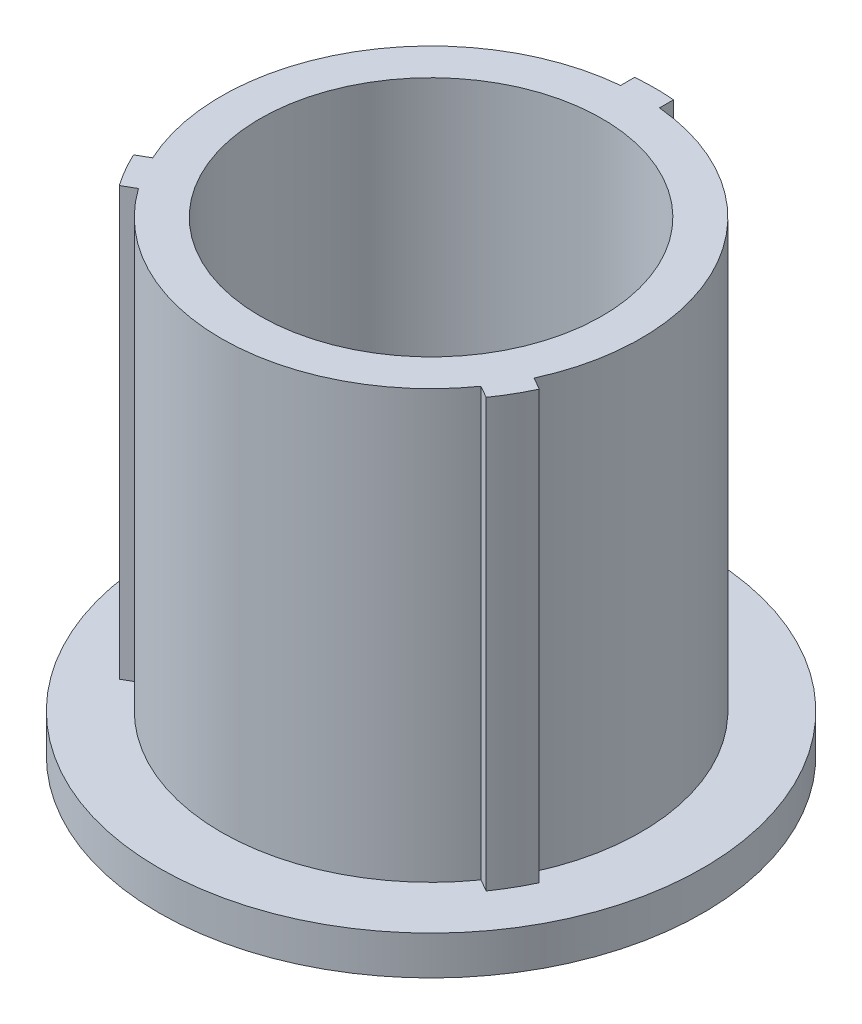
ISO-10303-21;
HEADER;
FILE_DESCRIPTION(('STEP AP214'),'2;1');
FILE_NAME('part.step','',(''),(''),'','','');
FILE_SCHEMA(('AUTOMOTIVE_DESIGN { 1 0 10303 214 1 1 1 1 }'));
ENDSEC;
DATA;
#1=APPLICATION_CONTEXT('core data for automotive mechanical design processes');
#2=APPLICATION_PROTOCOL_DEFINITION('international standard','automotive_design',2000,#1);
#3=PRODUCT_CONTEXT('',#1,'mechanical');
#4=PRODUCT('Part','Part','',(#3));
#5=PRODUCT_RELATED_PRODUCT_CATEGORY('part','',(#4));
#6=PRODUCT_DEFINITION_FORMATION('','',#4);
#7=PRODUCT_DEFINITION_CONTEXT('part definition',#1,'design');
#8=PRODUCT_DEFINITION('design','',#6,#7);
#9=PRODUCT_DEFINITION_SHAPE('','',#8);
#10=(LENGTH_UNIT() NAMED_UNIT(*) SI_UNIT(.MILLI.,.METRE.));
#11=(NAMED_UNIT(*) PLANE_ANGLE_UNIT() SI_UNIT($,.RADIAN.));
#12=(NAMED_UNIT(*) SI_UNIT($,.STERADIAN.) SOLID_ANGLE_UNIT());
#13=UNCERTAINTY_MEASURE_WITH_UNIT(LENGTH_MEASURE(1.E-05),#10,'distance_accuracy_value','');
#14=(GEOMETRIC_REPRESENTATION_CONTEXT(3) GLOBAL_UNCERTAINTY_ASSIGNED_CONTEXT((#13)) GLOBAL_UNIT_ASSIGNED_CONTEXT((#10,
#11,#12)) REPRESENTATION_CONTEXT('',''));
#15=CARTESIAN_POINT('',(0.,0.,0.));
#16=DIRECTION('',(0.,0.,1.));
#17=DIRECTION('',(1.,0.,0.));
#18=AXIS2_PLACEMENT_3D('',#15,#16,#17);
#19=CARTESIAN_POINT('',(0.,19.05,0.));
#20=DIRECTION('',(0.,-1.,0.));
#21=DIRECTION('',(0.,0.,-1.));
#22=AXIS2_PLACEMENT_3D('',#19,#20,#21);
#23=CYLINDRICAL_SURFACE('',#22,9.144);
#24=CARTESIAN_POINT('',(0.,1.58750000000001,0.));
#25=DIRECTION('',(0.,1.,0.));
#26=DIRECTION('',(0.,0.,1.));
#27=AXIS2_PLACEMENT_3D('',#24,#25,#26);
#28=CIRCLE('',#27,9.144);
#29=CARTESIAN_POINT('',(0.793749999999991,1.58750000000002,-9.10948390072127));
#30=VERTEX_POINT('',#29);
#31=CARTESIAN_POINT('',(-0.793750000000006,1.58750000000001,-9.10948390072127));
#32=VERTEX_POINT('',#31);
#33=EDGE_CURVE('E139',#30,#32,#28,.T.);
#34=ORIENTED_EDGE('',*,*,#33,.T.);
#35=DIRECTION('',(0.,-1.,0.));
#36=VECTOR('',#35,1.);
#37=CARTESIAN_POINT('',(-0.793750000000006,19.05,-9.10948390072127));
#38=LINE('',#37,#36);
#39=CARTESIAN_POINT('',(-0.793750000000006,19.05,-9.10948390072127));
#40=VERTEX_POINT('',#39);
#41=EDGE_CURVE('E40',#40,#32,#38,.T.);
#42=ORIENTED_EDGE('',*,*,#41,.F.);
#43=CARTESIAN_POINT('',(0.,19.05,0.));
#44=DIRECTION('',(0.,1.,0.));
#45=DIRECTION('',(0.,0.,1.));
#46=AXIS2_PLACEMENT_3D('',#43,#44,#45);
#47=CIRCLE('',#46,9.144);
#48=CARTESIAN_POINT('',(0.793749999999991,19.05,-9.10948390072127));
#49=VERTEX_POINT('',#48);
#50=EDGE_CURVE('E167',#49,#40,#47,.T.);
#51=ORIENTED_EDGE('',*,*,#50,.F.);
#52=DIRECTION('',(0.,-1.,0.));
#53=VECTOR('',#52,1.);
#54=CARTESIAN_POINT('',(0.793749999999991,19.05,-9.10948390072127));
#55=LINE('',#54,#53);
#56=EDGE_CURVE('E124',#49,#30,#55,.T.);
#57=ORIENTED_EDGE('',*,*,#56,.T.);
#58=EDGE_LOOP('',(#34,#42,#51,#57));
#59=FACE_BOUND('',#58,.T.);
#60=ADVANCED_FACE('F32',(#59),#23,.T.);
#61=CARTESIAN_POINT('',(-0.793750000000006,19.05,-9.10948390072127));
#62=DIRECTION('',(1.,0.,3.15542680651737E-13));
#63=DIRECTION('',(3.15542680651737E-13,0.,-1.));
#64=AXIS2_PLACEMENT_3D('',#61,#62,#63);
#65=PLANE('',#64);
#66=DIRECTION('',(3.15542680651737E-13,0.,-1.));
#67=VECTOR('',#66,1.);
#68=CARTESIAN_POINT('',(-0.793750000000006,1.58750000000001,-9.10948390072127));
#69=LINE('',#68,#67);
#70=CARTESIAN_POINT('',(-0.793750000000187,1.58750000000001,-8.53567321231897));
#71=VERTEX_POINT('',#70);
#72=EDGE_CURVE('E141',#71,#32,#69,.T.);
#73=ORIENTED_EDGE('',*,*,#72,.F.);
#74=DIRECTION('',(0.,-1.,0.));
#75=VECTOR('',#74,1.);
#76=CARTESIAN_POINT('',(-0.793750000000187,19.05,-8.53567321231897));
#77=LINE('',#76,#75);
#78=CARTESIAN_POINT('',(-0.793750000000187,19.05,-8.53567321231897));
#79=VERTEX_POINT('',#78);
#80=EDGE_CURVE('E213',#79,#71,#77,.T.);
#81=ORIENTED_EDGE('',*,*,#80,.F.);
#82=DIRECTION('',(-3.15542680651737E-13,0.,1.));
#83=VECTOR('',#82,1.);
#84=CARTESIAN_POINT('',(-0.793750000000006,19.05,-9.10948390072127));
#85=LINE('',#84,#83);
#86=EDGE_CURVE('E169',#40,#79,#85,.T.);
#87=ORIENTED_EDGE('',*,*,#86,.F.);
#88=ORIENTED_EDGE('',*,*,#41,.T.);
#89=EDGE_LOOP('',(#73,#81,#87,#88));
#90=FACE_BOUND('',#89,.T.);
#91=ADVANCED_FACE('F217',(#90),#65,.F.);
#92=CARTESIAN_POINT('',(0.,19.05,0.));
#93=DIRECTION('',(0.,-1.,0.));
#94=DIRECTION('',(0.,0.,-1.));
#95=AXIS2_PLACEMENT_3D('',#92,#93,#94);
#96=CYLINDRICAL_SURFACE('',#95,8.5725);
#97=CARTESIAN_POINT('',(0.,1.58750000000001,0.));
#98=DIRECTION('',(0.,-1.,0.));
#99=DIRECTION('',(0.,0.,-1.));
#100=AXIS2_PLACEMENT_3D('',#97,#98,#99);
#101=CIRCLE('',#100,8.5725);
#102=CARTESIAN_POINT('',(-7.78898484027049,1.58750000000001,3.58042894190577));
#103=VERTEX_POINT('',#102);
#104=EDGE_CURVE('E164',#103,#71,#101,.T.);
#105=ORIENTED_EDGE('',*,*,#104,.F.);
#106=DIRECTION('',(0.,-1.,0.));
#107=VECTOR('',#106,1.);
#108=CARTESIAN_POINT('',(-7.78898484027049,19.05,3.58042894190577));
#109=LINE('',#108,#107);
#110=CARTESIAN_POINT('',(-7.78898484027049,19.05,3.58042894190577));
#111=VERTEX_POINT('',#110);
#112=EDGE_CURVE('E210',#111,#103,#109,.T.);
#113=ORIENTED_EDGE('',*,*,#112,.F.);
#114=CARTESIAN_POINT('',(0.,19.05,0.));
#115=DIRECTION('',(0.,1.,0.));
#116=DIRECTION('',(0.,0.,1.));
#117=AXIS2_PLACEMENT_3D('',#114,#115,#116);
#118=CIRCLE('',#117,8.5725);
#119=EDGE_CURVE('E171',#79,#111,#118,.T.);
#120=ORIENTED_EDGE('',*,*,#119,.F.);
#121=ORIENTED_EDGE('',*,*,#80,.T.);
#122=EDGE_LOOP('',(#105,#113,#120,#121));
#123=FACE_BOUND('',#122,.T.);
#124=ADVANCED_FACE('F224',(#123),#96,.T.);
#125=CARTESIAN_POINT('',(-8.28591947338998,19.05,3.86733428610674));
#126=DIRECTION('',(0.499999999999724,0.,0.866025403784598));
#127=DIRECTION('',(0.866025403784598,0.,-0.499999999999724));
#128=AXIS2_PLACEMENT_3D('',#125,#126,#127);
#129=PLANE('',#128);
#130=DIRECTION('',(0.866025403784598,0.,-0.499999999999724));
#131=VECTOR('',#130,1.);
#132=CARTESIAN_POINT('',(-8.28591947338998,1.58750000000001,3.86733428610674));
#133=LINE('',#132,#131);
#134=CARTESIAN_POINT('',(-8.28591947338998,1.58750000000001,3.86733428610675));
#135=VERTEX_POINT('',#134);
#136=EDGE_CURVE('E161',#135,#103,#133,.T.);
#137=ORIENTED_EDGE('',*,*,#136,.F.);
#138=DIRECTION('',(0.,-1.,0.));
#139=VECTOR('',#138,1.);
#140=CARTESIAN_POINT('',(-8.28591947338998,19.05,3.86733428610674));
#141=LINE('',#140,#139);
#142=CARTESIAN_POINT('',(-8.28591947338998,19.05,3.86733428610674));
#143=VERTEX_POINT('',#142);
#144=EDGE_CURVE('E207',#143,#135,#141,.T.);
#145=ORIENTED_EDGE('',*,*,#144,.F.);
#146=DIRECTION('',(-0.866025403784598,0.,0.499999999999724));
#147=VECTOR('',#146,1.);
#148=CARTESIAN_POINT('',(-8.28591947338998,19.05,3.86733428610674));
#149=LINE('',#148,#147);
#150=EDGE_CURVE('E173',#111,#143,#149,.T.);
#151=ORIENTED_EDGE('',*,*,#150,.F.);
#152=ORIENTED_EDGE('',*,*,#112,.T.);
#153=EDGE_LOOP('',(#137,#145,#151,#152));
#154=FACE_BOUND('',#153,.T.);
#155=ADVANCED_FACE('F228',(#154),#129,.F.);
#156=CARTESIAN_POINT('',(0.,19.05,0.));
#157=DIRECTION('',(0.,-1.,0.));
#158=DIRECTION('',(0.,0.,-1.));
#159=AXIS2_PLACEMENT_3D('',#156,#157,#158);
#160=CYLINDRICAL_SURFACE('',#159,9.144);
#161=CARTESIAN_POINT('',(-7.49216947338998,1.58750000000001,5.24214961461454));
#162=VERTEX_POINT('',#161);
#163=EDGE_CURVE('E145',#135,#162,#28,.T.);
#164=ORIENTED_EDGE('',*,*,#163,.T.);
#165=DIRECTION('',(0.,-1.,0.));
#166=VECTOR('',#165,1.);
#167=CARTESIAN_POINT('',(-7.49216947338997,19.05,5.24214961461454));
#168=LINE('',#167,#166);
#169=CARTESIAN_POINT('',(-7.49216947338997,19.05,5.24214961461454));
#170=VERTEX_POINT('',#169);
#171=EDGE_CURVE('E204',#170,#162,#168,.T.);
#172=ORIENTED_EDGE('',*,*,#171,.F.);
#173=CARTESIAN_POINT('',(0.,19.05,0.));
#174=DIRECTION('',(0.,1.,0.));
#175=DIRECTION('',(0.,0.,1.));
#176=AXIS2_PLACEMENT_3D('',#173,#174,#175);
#177=CIRCLE('',#176,9.144);
#178=EDGE_CURVE('E175',#143,#170,#177,.T.);
#179=ORIENTED_EDGE('',*,*,#178,.F.);
#180=ORIENTED_EDGE('',*,*,#144,.T.);
#181=EDGE_LOOP('',(#164,#172,#179,#180));
#182=FACE_BOUND('',#181,.T.);
#183=ADVANCED_FACE('F234',(#182),#160,.T.);
#184=CARTESIAN_POINT('',(-7.49216947338998,19.05,5.24214961461454));
#185=DIRECTION('',(-0.499999999999723,0.,-0.866025403784599));
#186=DIRECTION('',(-0.866025403784599,0.,0.499999999999723));
#187=AXIS2_PLACEMENT_3D('',#184,#185,#186);
#188=PLANE('',#187);
#189=DIRECTION('',(-0.866025403784599,0.,0.499999999999723));
#190=VECTOR('',#189,1.);
#191=CARTESIAN_POINT('',(-7.49216947338998,1.58750000000001,5.24214961461454));
#192=LINE('',#191,#190);
#193=CARTESIAN_POINT('',(-6.99523484027046,1.58750000000001,4.95524427041355));
#194=VERTEX_POINT('',#193);
#195=EDGE_CURVE('E158',#194,#162,#192,.T.);
#196=ORIENTED_EDGE('',*,*,#195,.F.);
#197=DIRECTION('',(0.,-1.,0.));
#198=VECTOR('',#197,1.);
#199=CARTESIAN_POINT('',(-6.99523484027046,19.05,4.95524427041355));
#200=LINE('',#199,#198);
#201=CARTESIAN_POINT('',(-6.99523484027046,19.05,4.95524427041355));
#202=VERTEX_POINT('',#201);
#203=EDGE_CURVE('E201',#202,#194,#200,.T.);
#204=ORIENTED_EDGE('',*,*,#203,.F.);
#205=DIRECTION('',(0.866025403784599,0.,-0.499999999999723));
#206=VECTOR('',#205,1.);
#207=CARTESIAN_POINT('',(-7.49216947338998,19.05,5.24214961461454));
#208=LINE('',#207,#206);
#209=EDGE_CURVE('E177',#170,#202,#208,.T.);
#210=ORIENTED_EDGE('',*,*,#209,.F.);
#211=ORIENTED_EDGE('',*,*,#171,.T.);
#212=EDGE_LOOP('',(#196,#204,#210,#211));
#213=FACE_BOUND('',#212,.T.);
#214=ADVANCED_FACE('F237',(#213),#188,.F.);
#215=CARTESIAN_POINT('',(0.,19.05,0.));
#216=DIRECTION('',(0.,-1.,0.));
#217=DIRECTION('',(0.,0.,-1.));
#218=AXIS2_PLACEMENT_3D('',#215,#216,#217);
#219=CYLINDRICAL_SURFACE('',#218,8.5725);
#220=CARTESIAN_POINT('',(0.,1.58750000000001,0.));
#221=DIRECTION('',(0.,-1.,0.));
#222=DIRECTION('',(0.,0.,-1.));
#223=AXIS2_PLACEMENT_3D('',#220,#221,#222);
#224=CIRCLE('',#223,8.5725);
#225=CARTESIAN_POINT('',(6.99523484027068,1.58750000000001,4.95524427041324));
#226=VERTEX_POINT('',#225);
#227=EDGE_CURVE('E155',#226,#194,#224,.T.);
#228=ORIENTED_EDGE('',*,*,#227,.F.);
#229=DIRECTION('',(0.,-1.,0.));
#230=VECTOR('',#229,1.);
#231=CARTESIAN_POINT('',(6.99523484027068,19.05,4.95524427041324));
#232=LINE('',#231,#230);
#233=CARTESIAN_POINT('',(6.99523484027068,19.05,4.95524427041324));
#234=VERTEX_POINT('',#233);
#235=EDGE_CURVE('E198',#234,#226,#232,.T.);
#236=ORIENTED_EDGE('',*,*,#235,.F.);
#237=CARTESIAN_POINT('',(0.,19.05,0.));
#238=DIRECTION('',(0.,1.,0.));
#239=DIRECTION('',(0.,0.,1.));
#240=AXIS2_PLACEMENT_3D('',#237,#238,#239);
#241=CIRCLE('',#240,8.5725);
#242=EDGE_CURVE('E179',#202,#234,#241,.T.);
#243=ORIENTED_EDGE('',*,*,#242,.F.);
#244=ORIENTED_EDGE('',*,*,#203,.T.);
#245=EDGE_LOOP('',(#228,#236,#243,#244));
#246=FACE_BOUND('',#245,.T.);
#247=ADVANCED_FACE('F241',(#246),#219,.T.);
#248=CARTESIAN_POINT('',(7.49216947338998,19.05,5.24214961461453));
#249=DIRECTION('',(0.500000000000273,0.,-0.866025403784281));
#250=DIRECTION('',(-0.866025403784281,0.,-0.500000000000273));
#251=AXIS2_PLACEMENT_3D('',#248,#249,#250);
#252=PLANE('',#251);
#253=DIRECTION('',(-0.866025403784281,0.,-0.500000000000273));
#254=VECTOR('',#253,1.);
#255=CARTESIAN_POINT('',(7.49216947338998,1.58750000000001,5.24214961461453));
#256=LINE('',#255,#254);
#257=CARTESIAN_POINT('',(7.49216947338998,1.58750000000001,5.24214961461453));
#258=VERTEX_POINT('',#257);
#259=EDGE_CURVE('E152',#258,#226,#256,.T.);
#260=ORIENTED_EDGE('',*,*,#259,.F.);
#261=DIRECTION('',(0.,-1.,0.));
#262=VECTOR('',#261,1.);
#263=CARTESIAN_POINT('',(7.49216947338998,19.05,5.24214961461453));
#264=LINE('',#263,#262);
#265=CARTESIAN_POINT('',(7.49216947338998,19.05,5.24214961461453));
#266=VERTEX_POINT('',#265);
#267=EDGE_CURVE('E195',#266,#258,#264,.T.);
#268=ORIENTED_EDGE('',*,*,#267,.F.);
#269=DIRECTION('',(0.866025403784281,0.,0.500000000000273));
#270=VECTOR('',#269,1.);
#271=CARTESIAN_POINT('',(7.49216947338998,19.05,5.24214961461453));
#272=LINE('',#271,#270);
#273=EDGE_CURVE('E181',#234,#266,#272,.T.);
#274=ORIENTED_EDGE('',*,*,#273,.F.);
#275=ORIENTED_EDGE('',*,*,#235,.T.);
#276=EDGE_LOOP('',(#260,#268,#274,#275));
#277=FACE_BOUND('',#276,.T.);
#278=ADVANCED_FACE('F247',(#277),#252,.F.);
#279=CARTESIAN_POINT('',(0.,19.05,0.));
#280=DIRECTION('',(0.,-1.,0.));
#281=DIRECTION('',(0.,0.,-1.));
#282=AXIS2_PLACEMENT_3D('',#279,#280,#281);
#283=CYLINDRICAL_SURFACE('',#282,9.144);
#284=CARTESIAN_POINT('',(8.28591947338998,1.58750000000001,3.86733428610673));
#285=VERTEX_POINT('',#284);
#286=EDGE_CURVE('E134',#258,#285,#28,.T.);
#287=ORIENTED_EDGE('',*,*,#286,.T.);
#288=DIRECTION('',(0.,-1.,0.));
#289=VECTOR('',#288,1.);
#290=CARTESIAN_POINT('',(8.28591947338998,19.05,3.86733428610673));
#291=LINE('',#290,#289);
#292=CARTESIAN_POINT('',(8.28591947338998,19.05,3.86733428610673));
#293=VERTEX_POINT('',#292);
#294=EDGE_CURVE('E192',#293,#285,#291,.T.);
#295=ORIENTED_EDGE('',*,*,#294,.F.);
#296=CARTESIAN_POINT('',(0.,19.05,0.));
#297=DIRECTION('',(0.,1.,0.));
#298=DIRECTION('',(0.,0.,1.));
#299=AXIS2_PLACEMENT_3D('',#296,#297,#298);
#300=CIRCLE('',#299,9.144);
#301=EDGE_CURVE('E183',#266,#293,#300,.T.);
#302=ORIENTED_EDGE('',*,*,#301,.F.);
#303=ORIENTED_EDGE('',*,*,#267,.T.);
#304=EDGE_LOOP('',(#287,#295,#302,#303));
#305=FACE_BOUND('',#304,.T.);
#306=ADVANCED_FACE('F250',(#305),#283,.T.);
#307=CARTESIAN_POINT('',(8.28591947338998,19.05,3.86733428610673));
#308=DIRECTION('',(-0.500000000000288,0.,0.866025403784272));
#309=DIRECTION('',(0.866025403784273,0.,0.500000000000288));
#310=AXIS2_PLACEMENT_3D('',#307,#308,#309);
#311=PLANE('',#310);
#312=DIRECTION('',(0.866025403784273,0.,0.500000000000288));
#313=VECTOR('',#312,1.);
#314=CARTESIAN_POINT('',(8.28591947338998,1.58750000000001,3.86733428610673));
#315=LINE('',#314,#313);
#316=CARTESIAN_POINT('',(7.78898484027065,1.58750000000001,3.58042894190542));
#317=VERTEX_POINT('',#316);
#318=EDGE_CURVE('E133',#317,#285,#315,.T.);
#319=ORIENTED_EDGE('',*,*,#318,.F.);
#320=DIRECTION('',(0.,-1.,0.));
#321=VECTOR('',#320,1.);
#322=CARTESIAN_POINT('',(7.78898484027065,19.05,3.58042894190542));
#323=LINE('',#322,#321);
#324=CARTESIAN_POINT('',(7.78898484027065,19.05,3.58042894190542));
#325=VERTEX_POINT('',#324);
#326=EDGE_CURVE('E123',#325,#317,#323,.T.);
#327=ORIENTED_EDGE('',*,*,#326,.F.);
#328=DIRECTION('',(-0.866025403784273,0.,-0.500000000000288));
#329=VECTOR('',#328,1.);
#330=CARTESIAN_POINT('',(8.28591947338998,19.05,3.86733428610673));
#331=LINE('',#330,#329);
#332=EDGE_CURVE('E185',#293,#325,#331,.T.);
#333=ORIENTED_EDGE('',*,*,#332,.F.);
#334=ORIENTED_EDGE('',*,*,#294,.T.);
#335=EDGE_LOOP('',(#319,#327,#333,#334));
#336=FACE_BOUND('',#335,.T.);
#337=ADVANCED_FACE('F253',(#336),#311,.F.);
#338=CARTESIAN_POINT('',(0.,19.05,0.));
#339=DIRECTION('',(0.,-1.,0.));
#340=DIRECTION('',(0.,0.,-1.));
#341=AXIS2_PLACEMENT_3D('',#338,#339,#340);
#342=CYLINDRICAL_SURFACE('',#341,8.5725);
#343=CARTESIAN_POINT('',(0.,1.58750000000001,0.));
#344=DIRECTION('',(0.,-1.,0.));
#345=DIRECTION('',(0.,0.,-1.));
#346=AXIS2_PLACEMENT_3D('',#343,#344,#345);
#347=CIRCLE('',#346,8.5725);
#348=CARTESIAN_POINT('',(0.793749999999813,1.58750000000001,-8.53567321231901));
#349=VERTEX_POINT('',#348);
#350=EDGE_CURVE('E128',#349,#317,#347,.T.);
#351=ORIENTED_EDGE('',*,*,#350,.F.);
#352=DIRECTION('',(0.,-1.,0.));
#353=VECTOR('',#352,1.);
#354=CARTESIAN_POINT('',(0.793749999999815,19.05,-8.53567321231901));
#355=LINE('',#354,#353);
#356=CARTESIAN_POINT('',(0.793749999999815,19.05,-8.53567321231901));
#357=VERTEX_POINT('',#356);
#358=EDGE_CURVE('E118',#357,#349,#355,.T.);
#359=ORIENTED_EDGE('',*,*,#358,.F.);
#360=CARTESIAN_POINT('',(0.,19.05,0.));
#361=DIRECTION('',(0.,1.,0.));
#362=DIRECTION('',(0.,0.,1.));
#363=AXIS2_PLACEMENT_3D('',#360,#361,#362);
#364=CIRCLE('',#363,8.5725);
#365=EDGE_CURVE('E187',#325,#357,#364,.T.);
#366=ORIENTED_EDGE('',*,*,#365,.F.);
#367=ORIENTED_EDGE('',*,*,#326,.T.);
#368=EDGE_LOOP('',(#351,#359,#366,#367));
#369=FACE_BOUND('',#368,.T.);
#370=ADVANCED_FACE('F129',(#369),#342,.T.);
#371=CARTESIAN_POINT('',(0.793749999999991,19.05,-9.10948390072127));
#372=DIRECTION('',(-1.,0.,-3.11196883253559E-13));
#373=DIRECTION('',(-3.11196883253559E-13,0.,1.));
#374=AXIS2_PLACEMENT_3D('',#371,#372,#373);
#375=PLANE('',#374);
#376=DIRECTION('',(-3.11196883253559E-13,0.,1.));
#377=VECTOR('',#376,1.);
#378=CARTESIAN_POINT('',(0.793749999999991,1.58750000000001,-9.10948390072127));
#379=LINE('',#378,#377);
#380=EDGE_CURVE('E11',#30,#349,#379,.T.);
#381=ORIENTED_EDGE('',*,*,#380,.F.);
#382=ORIENTED_EDGE('',*,*,#56,.F.);
#383=DIRECTION('',(3.11196883253559E-13,0.,-1.));
#384=VECTOR('',#383,1.);
#385=CARTESIAN_POINT('',(0.793749999999991,19.05,-9.10948390072127));
#386=LINE('',#385,#384);
#387=EDGE_CURVE('E53',#357,#49,#386,.T.);
#388=ORIENTED_EDGE('',*,*,#387,.F.);
#389=ORIENTED_EDGE('',*,*,#358,.T.);
#390=EDGE_LOOP('',(#381,#382,#388,#389));
#391=FACE_BOUND('',#390,.T.);
#392=ADVANCED_FACE('F120',(#391),#375,.F.);
#393=CARTESIAN_POINT('',(0.,19.05,0.));
#394=DIRECTION('',(0.,1.,0.));
#395=DIRECTION('',(0.,0.,1.));
#396=AXIS2_PLACEMENT_3D('',#393,#394,#395);
#397=PLANE('',#396);
#398=CARTESIAN_POINT('',(0.,19.05,0.));
#399=DIRECTION('',(0.,1.,0.));
#400=DIRECTION('',(0.,0.,1.));
#401=AXIS2_PLACEMENT_3D('',#398,#399,#400);
#402=CIRCLE('',#401,6.985);
#403=CARTESIAN_POINT('',(0.,19.05,6.985));
#404=VERTEX_POINT('',#403);
#405=EDGE_CURVE('E383',#404,#404,#402,.T.);
#406=ORIENTED_EDGE('',*,*,#405,.F.);
#407=EDGE_LOOP('',(#406));
#408=FACE_BOUND('',#407,.T.);
#409=ORIENTED_EDGE('',*,*,#50,.T.);
#410=ORIENTED_EDGE('',*,*,#86,.T.);
#411=ORIENTED_EDGE('',*,*,#119,.T.);
#412=ORIENTED_EDGE('',*,*,#150,.T.);
#413=ORIENTED_EDGE('',*,*,#178,.T.);
#414=ORIENTED_EDGE('',*,*,#209,.T.);
#415=ORIENTED_EDGE('',*,*,#242,.T.);
#416=ORIENTED_EDGE('',*,*,#273,.T.);
#417=ORIENTED_EDGE('',*,*,#301,.T.);
#418=ORIENTED_EDGE('',*,*,#332,.T.);
#419=ORIENTED_EDGE('',*,*,#365,.T.);
#420=ORIENTED_EDGE('',*,*,#387,.T.);
#421=EDGE_LOOP('',(#409,#410,#411,#412,#413,#414,#415,#416,#417,#418,#419,#420));
#422=FACE_BOUND('',#421,.T.);
#423=ADVANCED_FACE('F220',(#408,#422),#397,.T.);
#424=CARTESIAN_POINT('',(0.,1.58750000000001,-8.53567321231901));
#425=DIRECTION('',(0.,-1.,0.));
#426=DIRECTION('',(0.,0.,-1.));
#427=AXIS2_PLACEMENT_3D('',#424,#425,#426);
#428=PLANE('',#427);
#429=CARTESIAN_POINT('',(0.,1.58750000000001,0.));
#430=DIRECTION('',(0.,1.,0.));
#431=DIRECTION('',(0.,0.,1.));
#432=AXIS2_PLACEMENT_3D('',#429,#430,#431);
#433=CIRCLE('',#432,11.1125);
#434=CARTESIAN_POINT('',(0.,1.58750000000001,11.1125));
#435=VERTEX_POINT('',#434);
#436=EDGE_CURVE('E388',#435,#435,#433,.T.);
#437=ORIENTED_EDGE('',*,*,#436,.T.);
#438=EDGE_LOOP('',(#437));
#439=FACE_BOUND('',#438,.T.);
#440=ORIENTED_EDGE('',*,*,#72,.T.);
#441=ORIENTED_EDGE('',*,*,#33,.F.);
#442=ORIENTED_EDGE('',*,*,#380,.T.);
#443=ORIENTED_EDGE('',*,*,#350,.T.);
#444=ORIENTED_EDGE('',*,*,#318,.T.);
#445=ORIENTED_EDGE('',*,*,#286,.F.);
#446=ORIENTED_EDGE('',*,*,#259,.T.);
#447=ORIENTED_EDGE('',*,*,#227,.T.);
#448=ORIENTED_EDGE('',*,*,#195,.T.);
#449=ORIENTED_EDGE('',*,*,#163,.F.);
#450=ORIENTED_EDGE('',*,*,#136,.T.);
#451=ORIENTED_EDGE('',*,*,#104,.T.);
#452=EDGE_LOOP('',(#440,#441,#442,#443,#444,#445,#446,#447,#448,#449,#450,#451));
#453=FACE_BOUND('',#452,.T.);
#454=ADVANCED_FACE('F138',(#439,#453),#428,.F.);
#455=CARTESIAN_POINT('',(0.,4.48386457997676,0.));
#456=DIRECTION('',(0.,1.,0.));
#457=DIRECTION('',(0.,0.,1.));
#458=AXIS2_PLACEMENT_3D('',#455,#456,#457);
#459=CYLINDRICAL_SURFACE('',#458,11.1125);
#460=ORIENTED_EDGE('',*,*,#436,.F.);
#461=EDGE_LOOP('',(#460));
#462=FACE_BOUND('',#461,.T.);
#463=CARTESIAN_POINT('',(0.,0.,0.));
#464=DIRECTION('',(0.,1.,0.));
#465=DIRECTION('',(0.,0.,1.));
#466=AXIS2_PLACEMENT_3D('',#463,#464,#465);
#467=CIRCLE('',#466,11.1125);
#468=CARTESIAN_POINT('',(0.,0.,11.1125));
#469=VERTEX_POINT('',#468);
#470=EDGE_CURVE('E147',#469,#469,#467,.T.);
#471=ORIENTED_EDGE('',*,*,#470,.T.);
#472=EDGE_LOOP('',(#471));
#473=FACE_BOUND('',#472,.T.);
#474=ADVANCED_FACE('F317',(#462,#473),#459,.T.);
#475=CARTESIAN_POINT('',(0.,0.,0.));
#476=DIRECTION('',(0.,1.,0.));
#477=DIRECTION('',(0.,0.,1.));
#478=AXIS2_PLACEMENT_3D('',#475,#476,#477);
#479=PLANE('',#478);
#480=CARTESIAN_POINT('',(0.,0.,0.));
#481=DIRECTION('',(0.,-1.,0.));
#482=DIRECTION('',(0.,0.,-1.));
#483=AXIS2_PLACEMENT_3D('',#480,#481,#482);
#484=CIRCLE('',#483,4.826);
#485=CARTESIAN_POINT('',(0.,0.,-4.826));
#486=VERTEX_POINT('',#485);
#487=EDGE_CURVE('E381',#486,#486,#484,.T.);
#488=ORIENTED_EDGE('',*,*,#487,.F.);
#489=EDGE_LOOP('',(#488));
#490=FACE_BOUND('',#489,.T.);
#491=ORIENTED_EDGE('',*,*,#470,.F.);
#492=EDGE_LOOP('',(#491));
#493=FACE_BOUND('',#492,.T.);
#494=ADVANCED_FACE('F328',(#490,#493),#479,.F.);
#495=CARTESIAN_POINT('',(0.,2.032,0.));
#496=DIRECTION('',(0.,1.,0.));
#497=DIRECTION('',(0.,0.,1.));
#498=AXIS2_PLACEMENT_3D('',#495,#496,#497);
#499=CYLINDRICAL_SURFACE('',#498,6.985);
#500=CARTESIAN_POINT('',(0.,2.032,0.));
#501=DIRECTION('',(0.,1.,0.));
#502=DIRECTION('',(0.,0.,1.));
#503=AXIS2_PLACEMENT_3D('',#500,#501,#502);
#504=CIRCLE('',#503,6.985);
#505=CARTESIAN_POINT('',(0.,2.032,6.985));
#506=VERTEX_POINT('',#505);
#507=EDGE_CURVE('E385',#506,#506,#504,.T.);
#508=ORIENTED_EDGE('',*,*,#507,.F.);
#509=EDGE_LOOP('',(#508));
#510=FACE_BOUND('',#509,.T.);
#511=ORIENTED_EDGE('',*,*,#405,.T.);
#512=EDGE_LOOP('',(#511));
#513=FACE_BOUND('',#512,.T.);
#514=ADVANCED_FACE('F342',(#510,#513),#499,.F.);
#515=CARTESIAN_POINT('',(0.,2.032,0.));
#516=DIRECTION('',(0.,1.,0.));
#517=DIRECTION('',(0.,0.,1.));
#518=AXIS2_PLACEMENT_3D('',#515,#516,#517);
#519=PLANE('',#518);
#520=CARTESIAN_POINT('',(0.,2.032,0.));
#521=DIRECTION('',(0.,1.,0.));
#522=DIRECTION('',(0.,0.,1.));
#523=AXIS2_PLACEMENT_3D('',#520,#521,#522);
#524=CIRCLE('',#523,4.826);
#525=CARTESIAN_POINT('',(0.,2.032,4.826));
#526=VERTEX_POINT('',#525);
#527=EDGE_CURVE('E35',#526,#526,#524,.T.);
#528=ORIENTED_EDGE('',*,*,#527,.F.);
#529=EDGE_LOOP('',(#528));
#530=FACE_BOUND('',#529,.T.);
#531=ORIENTED_EDGE('',*,*,#507,.T.);
#532=EDGE_LOOP('',(#531));
#533=FACE_BOUND('',#532,.T.);
#534=ADVANCED_FACE('F347',(#530,#533),#519,.T.);
#535=CARTESIAN_POINT('',(0.,19.05,0.));
#536=DIRECTION('',(0.,-1.,0.));
#537=DIRECTION('',(0.,0.,-1.));
#538=AXIS2_PLACEMENT_3D('',#535,#536,#537);
#539=CYLINDRICAL_SURFACE('',#538,4.826);
#540=ORIENTED_EDGE('',*,*,#527,.T.);
#541=EDGE_LOOP('',(#540));
#542=FACE_BOUND('',#541,.T.);
#543=ORIENTED_EDGE('',*,*,#487,.T.);
#544=EDGE_LOOP('',(#543));
#545=FACE_BOUND('',#544,.T.);
#546=ADVANCED_FACE('F362',(#542,#545),#539,.F.);
#547=CLOSED_SHELL('',(#60,#91,#124,#155,#183,#214,#247,#278,#306,#337,#370,#392,#423,#454,#474,
#494,#514,#534,#546));
#548=MANIFOLD_SOLID_BREP('B2',#547);
#549=ADVANCED_BREP_SHAPE_REPRESENTATION('',(#18,#548),#14);
#550=SHAPE_DEFINITION_REPRESENTATION(#9,#549);
ENDSEC;
END-ISO-10303-21;
